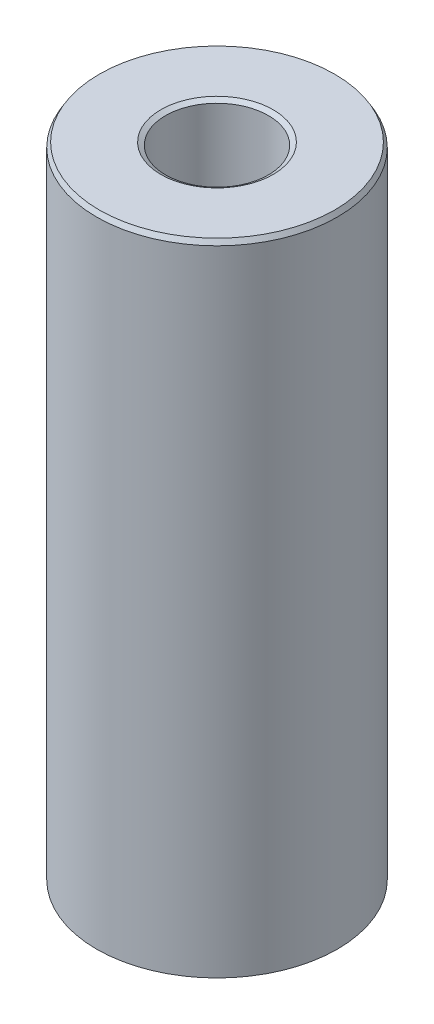
ISO-10303-21;
HEADER;
FILE_DESCRIPTION(('STEP AP214'),'2;1');
FILE_NAME('part.step','',(''),(''),'','','');
FILE_SCHEMA(('AUTOMOTIVE_DESIGN { 1 0 10303 214 1 1 1 1 }'));
ENDSEC;
DATA;
#1=APPLICATION_CONTEXT('core data for automotive mechanical design processes');
#2=APPLICATION_PROTOCOL_DEFINITION('international standard','automotive_design',2000,#1);
#3=PRODUCT_CONTEXT('',#1,'mechanical');
#4=PRODUCT('Part','Part','',(#3));
#5=PRODUCT_RELATED_PRODUCT_CATEGORY('part','',(#4));
#6=PRODUCT_DEFINITION_FORMATION('','',#4);
#7=PRODUCT_DEFINITION_CONTEXT('part definition',#1,'design');
#8=PRODUCT_DEFINITION('design','',#6,#7);
#9=PRODUCT_DEFINITION_SHAPE('','',#8);
#10=(LENGTH_UNIT() NAMED_UNIT(*) SI_UNIT(.MILLI.,.METRE.));
#11=(NAMED_UNIT(*) PLANE_ANGLE_UNIT() SI_UNIT($,.RADIAN.));
#12=(NAMED_UNIT(*) SI_UNIT($,.STERADIAN.) SOLID_ANGLE_UNIT());
#13=UNCERTAINTY_MEASURE_WITH_UNIT(LENGTH_MEASURE(1.E-05),#10,'distance_accuracy_value','');
#14=(GEOMETRIC_REPRESENTATION_CONTEXT(3) GLOBAL_UNCERTAINTY_ASSIGNED_CONTEXT((#13)) GLOBAL_UNIT_ASSIGNED_CONTEXT((#10,
#11,#12)) REPRESENTATION_CONTEXT('',''));
#15=CARTESIAN_POINT('',(0.,0.,0.));
#16=DIRECTION('',(0.,0.,1.));
#17=DIRECTION('',(1.,0.,0.));
#18=AXIS2_PLACEMENT_3D('',#15,#16,#17);
#19=CARTESIAN_POINT('',(0.,199.792994280492,0.));
#20=DIRECTION('',(0.,-1.,0.));
#21=DIRECTION('',(0.,0.,-1.));
#22=AXIS2_PLACEMENT_3D('',#19,#20,#21);
#23=CYLINDRICAL_SURFACE('',#22,37.5);
#24=CARTESIAN_POINT('',(0.,0.849463428609698,0.));
#25=DIRECTION('',(0.,1.,0.));
#26=DIRECTION('',(0.,0.,1.));
#27=AXIS2_PLACEMENT_3D('',#24,#25,#26);
#28=CIRCLE('',#27,37.5);
#29=CARTESIAN_POINT('',(0.,0.849463428609698,37.5));
#30=VERTEX_POINT('',#29);
#31=EDGE_CURVE('E10',#30,#30,#28,.T.);
#32=ORIENTED_EDGE('',*,*,#31,.T.);
#33=EDGE_LOOP('',(#32));
#34=FACE_BOUND('',#33,.T.);
#35=CARTESIAN_POINT('',(0.,198.321680462969,0.));
#36=DIRECTION('',(0.,1.,0.));
#37=DIRECTION('',(0.,0.,1.));
#38=AXIS2_PLACEMENT_3D('',#35,#36,#37);
#39=CIRCLE('',#38,37.5);
#40=CARTESIAN_POINT('',(0.,198.321680462969,37.5));
#41=VERTEX_POINT('',#40);
#42=EDGE_CURVE('E50',#41,#41,#39,.F.);
#43=ORIENTED_EDGE('',*,*,#42,.T.);
#44=EDGE_LOOP('',(#43));
#45=FACE_BOUND('',#44,.T.);
#46=ADVANCED_FACE('F39',(#34,#45),#23,.T.);
#47=CARTESIAN_POINT('',(0.,199.792994280492,0.));
#48=DIRECTION('',(0.,1.,0.));
#49=DIRECTION('',(0.,0.,1.));
#50=AXIS2_PLACEMENT_3D('',#47,#48,#49);
#51=PLANE('',#50);
#52=CARTESIAN_POINT('',(0.,199.792994280492,0.));
#53=DIRECTION('',(0.,1.,0.));
#54=DIRECTION('',(0.,0.,1.));
#55=AXIS2_PLACEMENT_3D('',#52,#53,#54);
#56=CIRCLE('',#55,17.4913627279524);
#57=CARTESIAN_POINT('',(0.,199.792994280492,17.4913627279524));
#58=VERTEX_POINT('',#57);
#59=EDGE_CURVE('E58',#58,#58,#56,.F.);
#60=ORIENTED_EDGE('',*,*,#59,.T.);
#61=EDGE_LOOP('',(#60));
#62=FACE_BOUND('',#61,.T.);
#63=CARTESIAN_POINT('',(0.,199.792994280492,0.));
#64=DIRECTION('',(0.,1.,0.));
#65=DIRECTION('',(0.,0.,1.));
#66=AXIS2_PLACEMENT_3D('',#63,#64,#65);
#67=CIRCLE('',#66,36.6505365713903);
#68=CARTESIAN_POINT('',(0.,199.792994280492,36.6505365713903));
#69=VERTEX_POINT('',#68);
#70=EDGE_CURVE('E61',#69,#69,#67,.T.);
#71=ORIENTED_EDGE('',*,*,#70,.T.);
#72=EDGE_LOOP('',(#71));
#73=FACE_BOUND('',#72,.T.);
#74=ADVANCED_FACE('F88',(#62,#73),#51,.T.);
#75=CARTESIAN_POINT('',(0.,0.,0.));
#76=DIRECTION('',(0.,1.,0.));
#77=DIRECTION('',(0.,0.,1.));
#78=AXIS2_PLACEMENT_3D('',#75,#76,#77);
#79=PLANE('',#78);
#80=CARTESIAN_POINT('',(0.,0.,0.));
#81=DIRECTION('',(0.,1.,0.));
#82=DIRECTION('',(0.,0.,1.));
#83=AXIS2_PLACEMENT_3D('',#80,#81,#82);
#84=CIRCLE('',#83,16.8695123390384);
#85=CARTESIAN_POINT('',(0.,0.,16.8695123390384));
#86=VERTEX_POINT('',#85);
#87=EDGE_CURVE('E51',#86,#86,#84,.T.);
#88=ORIENTED_EDGE('',*,*,#87,.T.);
#89=EDGE_LOOP('',(#88));
#90=FACE_BOUND('',#89,.T.);
#91=CARTESIAN_POINT('',(0.,0.,0.));
#92=DIRECTION('',(0.,1.,0.));
#93=DIRECTION('',(0.,0.,1.));
#94=AXIS2_PLACEMENT_3D('',#91,#92,#93);
#95=CIRCLE('',#94,36.0286861824763);
#96=CARTESIAN_POINT('',(0.,0.,36.0286861824763));
#97=VERTEX_POINT('',#96);
#98=EDGE_CURVE('E54',#97,#97,#95,.F.);
#99=ORIENTED_EDGE('',*,*,#98,.T.);
#100=EDGE_LOOP('',(#99));
#101=FACE_BOUND('',#100,.T.);
#102=ADVANCED_FACE('F83',(#90,#101),#79,.F.);
#103=CARTESIAN_POINT('',(0.,199.792994280492,0.));
#104=DIRECTION('',(0.,-1.,0.));
#105=DIRECTION('',(0.,0.,-1.));
#106=AXIS2_PLACEMENT_3D('',#103,#104,#105);
#107=CYLINDRICAL_SURFACE('',#106,16.0200489104287);
#108=CARTESIAN_POINT('',(0.,198.943530851883,0.));
#109=DIRECTION('',(0.,1.,0.));
#110=DIRECTION('',(0.,0.,1.));
#111=AXIS2_PLACEMENT_3D('',#108,#109,#110);
#112=CIRCLE('',#111,16.0200489104287);
#113=CARTESIAN_POINT('',(0.,198.943530851883,16.0200489104287));
#114=VERTEX_POINT('',#113);
#115=EDGE_CURVE('E67',#114,#114,#112,.T.);
#116=ORIENTED_EDGE('',*,*,#115,.T.);
#117=EDGE_LOOP('',(#116));
#118=FACE_BOUND('',#117,.T.);
#119=CARTESIAN_POINT('',(0.,1.47131381752372,0.));
#120=DIRECTION('',(0.,1.,0.));
#121=DIRECTION('',(0.,0.,1.));
#122=AXIS2_PLACEMENT_3D('',#119,#120,#121);
#123=CIRCLE('',#122,16.0200489104287);
#124=CARTESIAN_POINT('',(0.,1.47131381752372,16.0200489104287));
#125=VERTEX_POINT('',#124);
#126=EDGE_CURVE('E69',#125,#125,#123,.F.);
#127=ORIENTED_EDGE('',*,*,#126,.T.);
#128=EDGE_LOOP('',(#127));
#129=FACE_BOUND('',#128,.T.);
#130=ADVANCED_FACE('F71',(#118,#129),#107,.F.);
#131=CARTESIAN_POINT('',(0.,198.943530851883,0.));
#132=DIRECTION('',(0.,1.,0.));
#133=DIRECTION('',(0.,0.,1.));
#134=AXIS2_PLACEMENT_3D('',#131,#132,#133);
#135=CONICAL_SURFACE('',#134,16.0200489104287,1.0471975511966);
#136=ORIENTED_EDGE('',*,*,#59,.F.);
#137=EDGE_LOOP('',(#136));
#138=FACE_BOUND('',#137,.T.);
#139=ORIENTED_EDGE('',*,*,#115,.F.);
#140=EDGE_LOOP('',(#139));
#141=FACE_BOUND('',#140,.T.);
#142=ADVANCED_FACE('F77',(#138,#141),#135,.F.);
#143=CARTESIAN_POINT('',(0.,0.,0.));
#144=DIRECTION('',(0.,-1.,0.));
#145=DIRECTION('',(0.,0.,-1.));
#146=AXIS2_PLACEMENT_3D('',#143,#144,#145);
#147=CONICAL_SURFACE('',#146,16.8695123390384,0.523598775598298);
#148=ORIENTED_EDGE('',*,*,#126,.F.);
#149=EDGE_LOOP('',(#148));
#150=FACE_BOUND('',#149,.T.);
#151=ORIENTED_EDGE('',*,*,#87,.F.);
#152=EDGE_LOOP('',(#151));
#153=FACE_BOUND('',#152,.T.);
#154=ADVANCED_FACE('F73',(#150,#153),#147,.F.);
#155=CARTESIAN_POINT('',(0.,0.849463428609698,0.));
#156=DIRECTION('',(0.,1.,0.));
#157=DIRECTION('',(0.,0.,1.));
#158=AXIS2_PLACEMENT_3D('',#155,#156,#157);
#159=CONICAL_SURFACE('',#158,37.5,1.04719755119661);
#160=ORIENTED_EDGE('',*,*,#98,.F.);
#161=EDGE_LOOP('',(#160));
#162=FACE_BOUND('',#161,.T.);
#163=ORIENTED_EDGE('',*,*,#31,.F.);
#164=EDGE_LOOP('',(#163));
#165=FACE_BOUND('',#164,.T.);
#166=ADVANCED_FACE('F76',(#162,#165),#159,.T.);
#167=CARTESIAN_POINT('',(0.,199.792994280492,0.));
#168=DIRECTION('',(0.,-1.,0.));
#169=DIRECTION('',(0.,0.,-1.));
#170=AXIS2_PLACEMENT_3D('',#167,#168,#169);
#171=CONICAL_SURFACE('',#170,36.6505365713903,0.523598775598302);
#172=ORIENTED_EDGE('',*,*,#42,.F.);
#173=EDGE_LOOP('',(#172));
#174=FACE_BOUND('',#173,.T.);
#175=ORIENTED_EDGE('',*,*,#70,.F.);
#176=EDGE_LOOP('',(#175));
#177=FACE_BOUND('',#176,.T.);
#178=ADVANCED_FACE('F45',(#174,#177),#171,.T.);
#179=CLOSED_SHELL('',(#46,#74,#102,#130,#142,#154,#166,#178));
#180=MANIFOLD_SOLID_BREP('B2',#179);
#181=ADVANCED_BREP_SHAPE_REPRESENTATION('',(#18,#180),#14);
#182=SHAPE_DEFINITION_REPRESENTATION(#9,#181);
ENDSEC;
END-ISO-10303-21;
